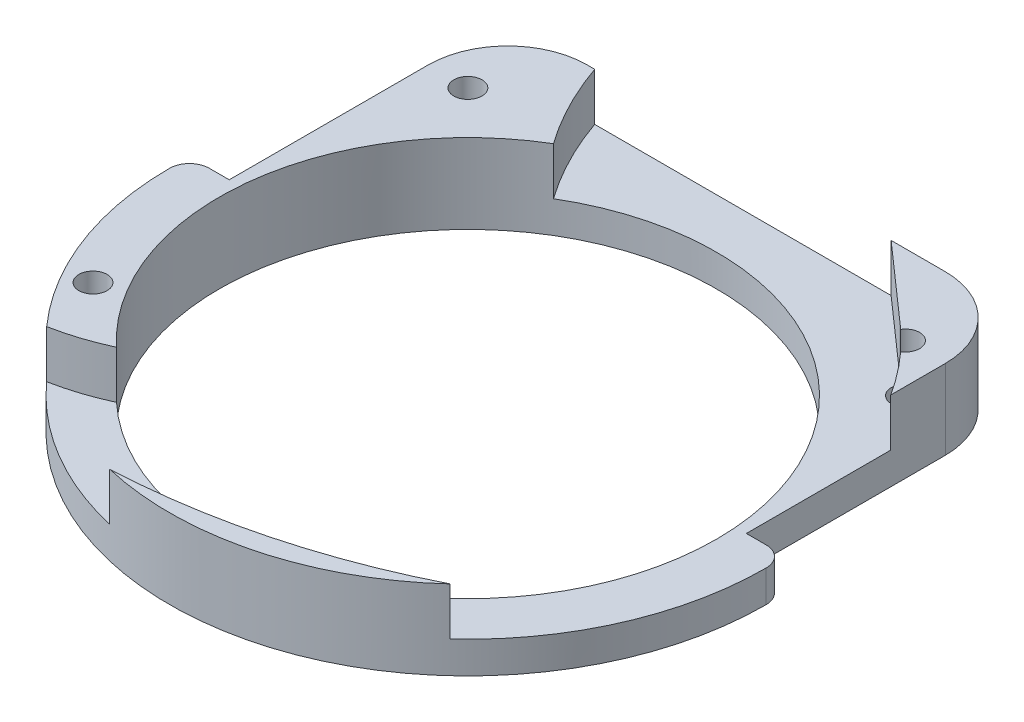
ISO-10303-21;
HEADER;
FILE_DESCRIPTION(('STEP AP214'),'2;1');
FILE_NAME('part.step','',(''),(''),'','','');
FILE_SCHEMA(('AUTOMOTIVE_DESIGN { 1 0 10303 214 1 1 1 1 }'));
ENDSEC;
DATA;
#1=APPLICATION_CONTEXT('core data for automotive mechanical design processes');
#2=APPLICATION_PROTOCOL_DEFINITION('international standard','automotive_design',2000,#1);
#3=PRODUCT_CONTEXT('',#1,'mechanical');
#4=PRODUCT('Part','Part','',(#3));
#5=PRODUCT_RELATED_PRODUCT_CATEGORY('part','',(#4));
#6=PRODUCT_DEFINITION_FORMATION('','',#4);
#7=PRODUCT_DEFINITION_CONTEXT('part definition',#1,'design');
#8=PRODUCT_DEFINITION('design','',#6,#7);
#9=PRODUCT_DEFINITION_SHAPE('','',#8);
#10=(LENGTH_UNIT() NAMED_UNIT(*) SI_UNIT(.MILLI.,.METRE.));
#11=(NAMED_UNIT(*) PLANE_ANGLE_UNIT() SI_UNIT($,.RADIAN.));
#12=(NAMED_UNIT(*) SI_UNIT($,.STERADIAN.) SOLID_ANGLE_UNIT());
#13=UNCERTAINTY_MEASURE_WITH_UNIT(LENGTH_MEASURE(1.E-05),#10,'distance_accuracy_value','');
#14=(GEOMETRIC_REPRESENTATION_CONTEXT(3) GLOBAL_UNCERTAINTY_ASSIGNED_CONTEXT((#13)) GLOBAL_UNIT_ASSIGNED_CONTEXT((#10,
#11,#12)) REPRESENTATION_CONTEXT('',''));
#15=CARTESIAN_POINT('',(0.,0.,0.));
#16=DIRECTION('',(0.,0.,1.));
#17=DIRECTION('',(1.,0.,0.));
#18=AXIS2_PLACEMENT_3D('',#15,#16,#17);
#19=CARTESIAN_POINT('',(0.,12.7,0.));
#20=DIRECTION('',(0.,1.,0.));
#21=DIRECTION('',(0.,0.,1.));
#22=AXIS2_PLACEMENT_3D('',#19,#20,#21);
#23=PLANE('',#22);
#24=CARTESIAN_POINT('',(-15.875,12.7,-60.325));
#25=DIRECTION('',(0.,1.,0.));
#26=DIRECTION('',(0.,0.,1.));
#27=AXIS2_PLACEMENT_3D('',#24,#25,#26);
#28=CIRCLE('',#27,106.828852586433);
#29=CARTESIAN_POINT('',(-10.8036837942564,12.7,46.3834134305974));
#30=VERTEX_POINT('',#29);
#31=CARTESIAN_POINT('',(32.2354567530664,12.7,35.0573238128808));
#32=VERTEX_POINT('',#31);
#33=EDGE_CURVE('E210',#30,#32,#28,.T.);
#34=ORIENTED_EDGE('',*,*,#33,.F.);
#35=CARTESIAN_POINT('',(0.,12.7,0.));
#36=DIRECTION('',(0.,1.,0.));
#37=DIRECTION('',(0.,0.,1.));
#38=AXIS2_PLACEMENT_3D('',#35,#36,#37);
#39=CIRCLE('',#38,47.625);
#40=EDGE_CURVE('E267',#30,#32,#39,.T.);
#41=ORIENTED_EDGE('',*,*,#40,.T.);
#42=EDGE_LOOP('',(#34,#41));
#43=FACE_BOUND('',#42,.T.);
#44=ADVANCED_FACE('F33',(#43),#23,.T.);
#45=CARTESIAN_POINT('',(-37.9449030668151,12.7,21.9075000000001));
#46=DIRECTION('',(0.,1.,0.));
#47=DIRECTION('',(0.,0.,1.));
#48=AXIS2_PLACEMENT_3D('',#45,#46,#47);
#49=CIRCLE('',#48,2.25);
#50=CARTESIAN_POINT('',(-37.9449030668151,12.7,24.1575000000001));
#51=VERTEX_POINT('',#50);
#52=EDGE_CURVE('E487',#51,#51,#49,.T.);
#53=ORIENTED_EDGE('',*,*,#52,.F.);
#54=EDGE_LOOP('',(#53));
#55=FACE_BOUND('',#54,.T.);
#56=CARTESIAN_POINT('',(-42.3702024676522,12.7,-3.85265724535526));
#57=DIRECTION('',(0.,-1.,0.));
#58=DIRECTION('',(0.,0.,1.));
#59=AXIS2_PLACEMENT_3D('',#56,#57,#58);
#60=CIRCLE('',#59,36.1950000000003);
#61=CARTESIAN_POINT('',(-27.1222333184053,12.7,28.9738177683229));
#62=VERTEX_POINT('',#61);
#63=CARTESIAN_POINT('',(-35.5479612812167,12.7,31.6935809549681));
#64=VERTEX_POINT('',#63);
#65=EDGE_CURVE('E219',#62,#64,#60,.T.);
#66=ORIENTED_EDGE('',*,*,#65,.F.);
#67=CARTESIAN_POINT('',(0.,12.7,0.));
#68=DIRECTION('',(0.,1.,0.));
#69=DIRECTION('',(0.,0.,1.));
#70=AXIS2_PLACEMENT_3D('',#67,#68,#69);
#71=CIRCLE('',#70,39.6875);
#72=CARTESIAN_POINT('',(-20.3892672085371,12.7,-34.049602625418));
#73=VERTEX_POINT('',#72);
#74=EDGE_CURVE('E257',#73,#62,#71,.T.);
#75=ORIENTED_EDGE('',*,*,#74,.F.);
#76=CARTESIAN_POINT('',(23.6115430728493,12.7,-65.310269918063));
#77=DIRECTION('',(0.,1.,0.));
#78=DIRECTION('',(0.,0.,-1.));
#79=AXIS2_PLACEMENT_3D('',#76,#77,#78);
#80=CIRCLE('',#79,53.975);
#81=CARTESIAN_POINT('',(-27.3838670434078,12.7,-47.625));
#82=VERTEX_POINT('',#81);
#83=EDGE_CURVE('E217',#82,#73,#80,.T.);
#84=ORIENTED_EDGE('',*,*,#83,.F.);
#85=DIRECTION('',(-1.,0.,0.));
#86=VECTOR('',#85,1.);
#87=CARTESIAN_POINT('',(-41.275,12.7,-47.625));
#88=LINE('',#87,#86);
#89=CARTESIAN_POINT('',(-28.575,12.7,-47.625));
#90=VERTEX_POINT('',#89);
#91=EDGE_CURVE('E269',#82,#90,#88,.T.);
#92=ORIENTED_EDGE('',*,*,#91,.T.);
#93=CARTESIAN_POINT('',(-28.575,12.7,-34.925));
#94=DIRECTION('',(0.,1.,0.));
#95=DIRECTION('',(0.,0.,1.));
#96=AXIS2_PLACEMENT_3D('',#93,#94,#95);
#97=CIRCLE('',#96,12.7);
#98=CARTESIAN_POINT('',(-41.275,12.7,-34.925));
#99=VERTEX_POINT('',#98);
#100=EDGE_CURVE('E315',#90,#99,#97,.T.);
#101=ORIENTED_EDGE('',*,*,#100,.T.);
#102=DIRECTION('',(0.,0.,1.));
#103=VECTOR('',#102,1.);
#104=CARTESIAN_POINT('',(-41.275,12.7,-3.175));
#105=LINE('',#104,#103);
#106=CARTESIAN_POINT('',(-41.275,12.7,-3.175));
#107=VERTEX_POINT('',#106);
#108=EDGE_CURVE('E273',#99,#107,#105,.T.);
#109=ORIENTED_EDGE('',*,*,#108,.T.);
#110=DIRECTION('',(-1.,0.,0.));
#111=VECTOR('',#110,1.);
#112=CARTESIAN_POINT('',(-47.625,12.7,-3.175));
#113=LINE('',#112,#111);
#114=CARTESIAN_POINT('',(-44.45,12.7,-3.175));
#115=VERTEX_POINT('',#114);
#116=EDGE_CURVE('E275',#107,#115,#113,.T.);
#117=ORIENTED_EDGE('',*,*,#116,.T.);
#118=CARTESIAN_POINT('',(-44.45,12.7,0.));
#119=DIRECTION('',(0.,1.,0.));
#120=DIRECTION('',(0.,0.,1.));
#121=AXIS2_PLACEMENT_3D('',#118,#119,#120);
#122=CIRCLE('',#121,3.175);
#123=CARTESIAN_POINT('',(-47.625,12.7,0.));
#124=VERTEX_POINT('',#123);
#125=EDGE_CURVE('E329',#115,#124,#122,.T.);
#126=ORIENTED_EDGE('',*,*,#125,.T.);
#127=EDGE_CURVE('E263',#124,#64,#39,.T.);
#128=ORIENTED_EDGE('',*,*,#127,.T.);
#129=EDGE_LOOP('',(#66,#75,#84,#92,#101,#109,#117,#126,#128));
#130=FACE_BOUND('',#129,.T.);
#131=CARTESIAN_POINT('',(-34.925,12.7,-34.925));
#132=DIRECTION('',(0.,1.,0.));
#133=DIRECTION('',(0.,0.,1.));
#134=AXIS2_PLACEMENT_3D('',#131,#132,#133);
#135=CIRCLE('',#134,2.25);
#136=CARTESIAN_POINT('',(-34.925,12.7,-32.675));
#137=VERTEX_POINT('',#136);
#138=EDGE_CURVE('E248',#137,#137,#135,.T.);
#139=ORIENTED_EDGE('',*,*,#138,.F.);
#140=EDGE_LOOP('',(#139));
#141=FACE_BOUND('',#140,.T.);
#142=ADVANCED_FACE('F356',(#55,#130,#141),#23,.T.);
#143=CARTESIAN_POINT('',(41.275,12.7,-3.175));
#144=DIRECTION('',(0.,0.,1.));
#145=DIRECTION('',(1.,0.,0.));
#146=AXIS2_PLACEMENT_3D('',#143,#144,#145);
#147=PLANE('',#146);
#148=DIRECTION('',(-1.,0.,0.));
#149=VECTOR('',#148,1.);
#150=CARTESIAN_POINT('',(41.275,5.08,-3.175));
#151=LINE('',#150,#149);
#152=CARTESIAN_POINT('',(44.45,5.08,-3.175));
#153=VERTEX_POINT('',#152);
#154=CARTESIAN_POINT('',(41.275,5.08,-3.175));
#155=VERTEX_POINT('',#154);
#156=EDGE_CURVE('E223',#153,#155,#151,.T.);
#157=ORIENTED_EDGE('',*,*,#156,.F.);
#158=DIRECTION('',(0.,-1.,0.));
#159=VECTOR('',#158,1.);
#160=CARTESIAN_POINT('',(44.45,12.7,-3.175));
#161=LINE('',#160,#159);
#162=CARTESIAN_POINT('',(44.45,0.,-3.175));
#163=VERTEX_POINT('',#162);
#164=EDGE_CURVE('E322',#153,#163,#161,.T.);
#165=ORIENTED_EDGE('',*,*,#164,.T.);
#166=DIRECTION('',(-1.,0.,0.));
#167=VECTOR('',#166,1.);
#168=CARTESIAN_POINT('',(41.275,0.,-3.175));
#169=LINE('',#168,#167);
#170=CARTESIAN_POINT('',(41.275,0.,-3.175));
#171=VERTEX_POINT('',#170);
#172=EDGE_CURVE('E280',#163,#171,#169,.T.);
#173=ORIENTED_EDGE('',*,*,#172,.T.);
#174=DIRECTION('',(0.,-1.,0.));
#175=VECTOR('',#174,1.);
#176=CARTESIAN_POINT('',(41.275,12.7,-3.175));
#177=LINE('',#176,#175);
#178=EDGE_CURVE('E298',#155,#171,#177,.T.);
#179=ORIENTED_EDGE('',*,*,#178,.F.);
#180=EDGE_LOOP('',(#157,#165,#173,#179));
#181=FACE_BOUND('',#180,.T.);
#182=ADVANCED_FACE('F362',(#181),#147,.F.);
#183=CARTESIAN_POINT('',(44.45,12.7,0.));
#184=DIRECTION('',(0.,-1.,0.));
#185=DIRECTION('',(0.,0.,-1.));
#186=AXIS2_PLACEMENT_3D('',#183,#184,#185);
#187=CYLINDRICAL_SURFACE('',#186,3.175);
#188=ORIENTED_EDGE('',*,*,#164,.F.);
#189=CARTESIAN_POINT('',(44.45,5.08,0.));
#190=DIRECTION('',(0.,1.,0.));
#191=DIRECTION('',(0.,0.,1.));
#192=AXIS2_PLACEMENT_3D('',#189,#190,#191);
#193=CIRCLE('',#192,3.175);
#194=CARTESIAN_POINT('',(47.625,5.08,0.));
#195=VERTEX_POINT('',#194);
#196=EDGE_CURVE('E196',#153,#195,#193,.F.);
#197=ORIENTED_EDGE('',*,*,#196,.T.);
#198=DIRECTION('',(0.,-1.,0.));
#199=VECTOR('',#198,1.);
#200=CARTESIAN_POINT('',(47.625,12.7,0.));
#201=LINE('',#200,#199);
#202=CARTESIAN_POINT('',(47.625,0.,0.));
#203=VERTEX_POINT('',#202);
#204=EDGE_CURVE('E300',#195,#203,#201,.T.);
#205=ORIENTED_EDGE('',*,*,#204,.T.);
#206=CARTESIAN_POINT('',(44.45,0.,0.));
#207=DIRECTION('',(0.,1.,0.));
#208=DIRECTION('',(0.,0.,1.));
#209=AXIS2_PLACEMENT_3D('',#206,#207,#208);
#210=CIRCLE('',#209,3.175);
#211=EDGE_CURVE('E326',#163,#203,#210,.F.);
#212=ORIENTED_EDGE('',*,*,#211,.F.);
#213=EDGE_LOOP('',(#188,#197,#205,#212));
#214=FACE_BOUND('',#213,.T.);
#215=ADVANCED_FACE('F368',(#214),#187,.T.);
#216=CARTESIAN_POINT('',(0.,12.7,0.));
#217=DIRECTION('',(0.,1.,0.));
#218=DIRECTION('',(0.,0.,1.));
#219=AXIS2_PLACEMENT_3D('',#216,#217,#218);
#220=CIRCLE('',#219,48.895);
#221=CARTESIAN_POINT('',(41.275,12.7,-26.2125046494989));
#222=VERTEX_POINT('',#221);
#223=CARTESIAN_POINT('',(36.0830947099074,12.7,-32.9959285542301));
#224=VERTEX_POINT('',#223);
#225=EDGE_CURVE('E214',#222,#224,#220,.T.);
#226=ORIENTED_EDGE('',*,*,#225,.F.);
#227=DIRECTION('',(0.,0.,-1.));
#228=VECTOR('',#227,1.);
#229=CARTESIAN_POINT('',(41.275,12.7,-47.625));
#230=LINE('',#229,#228);
#231=CARTESIAN_POINT('',(41.275,12.7,-34.925));
#232=VERTEX_POINT('',#231);
#233=EDGE_CURVE('E266',#222,#232,#230,.T.);
#234=ORIENTED_EDGE('',*,*,#233,.T.);
#235=CARTESIAN_POINT('',(28.575,12.7,-34.925));
#236=DIRECTION('',(0.,1.,0.));
#237=DIRECTION('',(0.,0.,1.));
#238=AXIS2_PLACEMENT_3D('',#235,#236,#237);
#239=CIRCLE('',#238,12.7);
#240=CARTESIAN_POINT('',(28.575,12.7,-47.625));
#241=VERTEX_POINT('',#240);
#242=EDGE_CURVE('E317',#232,#241,#239,.T.);
#243=ORIENTED_EDGE('',*,*,#242,.T.);
#244=CARTESIAN_POINT('',(19.9319379994338,12.7,-47.625));
#245=VERTEX_POINT('',#244);
#246=EDGE_CURVE('E270',#241,#245,#88,.T.);
#247=ORIENTED_EDGE('',*,*,#246,.T.);
#248=DIRECTION('',(-0.749700903034031,0.,-0.661776817356092));
#249=VECTOR('',#248,1.);
#250=CARTESIAN_POINT('',(32.3575774846261,12.7,-36.656625653849));
#251=LINE('',#250,#249);
#252=CARTESIAN_POINT('',(32.3575774846261,12.7,-36.656625653849));
#253=VERTEX_POINT('',#252);
#254=EDGE_CURVE('E215',#253,#245,#251,.T.);
#255=ORIENTED_EDGE('',*,*,#254,.F.);
#256=CARTESIAN_POINT('',(32.9959285542301,12.7,-36.0830947099074));
#257=VERTEX_POINT('',#256);
#258=EDGE_CURVE('E193',#257,#253,#220,.T.);
#259=ORIENTED_EDGE('',*,*,#258,.F.);
#260=CARTESIAN_POINT('',(34.925,12.7,-34.925));
#261=DIRECTION('',(0.,1.,0.));
#262=DIRECTION('',(0.,0.,1.));
#263=AXIS2_PLACEMENT_3D('',#260,#261,#262);
#264=CIRCLE('',#263,2.25);
#265=EDGE_CURVE('E244',#224,#257,#264,.T.);
#266=ORIENTED_EDGE('',*,*,#265,.F.);
#267=EDGE_LOOP('',(#226,#234,#243,#247,#255,#259,#266));
#268=FACE_BOUND('',#267,.T.);
#269=ADVANCED_FACE('F358',(#268),#23,.T.);
#270=CARTESIAN_POINT('',(0.,0.,0.));
#271=DIRECTION('',(0.,1.,0.));
#272=DIRECTION('',(0.,0.,1.));
#273=AXIS2_PLACEMENT_3D('',#270,#271,#272);
#274=PLANE('',#273);
#275=CARTESIAN_POINT('',(-37.9449030668151,0.,21.9075000000001));
#276=DIRECTION('',(0.,1.,0.));
#277=DIRECTION('',(0.,0.,1.));
#278=AXIS2_PLACEMENT_3D('',#275,#276,#277);
#279=CIRCLE('',#278,2.25);
#280=CARTESIAN_POINT('',(-37.9449030668151,0.,24.1575000000001));
#281=VERTEX_POINT('',#280);
#282=EDGE_CURVE('E212',#281,#281,#279,.T.);
#283=ORIENTED_EDGE('',*,*,#282,.T.);
#284=EDGE_LOOP('',(#283));
#285=FACE_BOUND('',#284,.T.);
#286=CARTESIAN_POINT('',(34.925,0.,-34.925));
#287=DIRECTION('',(0.,1.,0.));
#288=DIRECTION('',(0.,0.,1.));
#289=AXIS2_PLACEMENT_3D('',#286,#287,#288);
#290=CIRCLE('',#289,2.25);
#291=CARTESIAN_POINT('',(34.925,0.,-32.675));
#292=VERTEX_POINT('',#291);
#293=EDGE_CURVE('E245',#292,#292,#290,.T.);
#294=ORIENTED_EDGE('',*,*,#293,.T.);
#295=EDGE_LOOP('',(#294));
#296=FACE_BOUND('',#295,.T.);
#297=CARTESIAN_POINT('',(-34.925,0.,-34.925));
#298=DIRECTION('',(0.,1.,0.));
#299=DIRECTION('',(0.,0.,1.));
#300=AXIS2_PLACEMENT_3D('',#297,#298,#299);
#301=CIRCLE('',#300,2.25);
#302=CARTESIAN_POINT('',(-34.925,0.,-32.675));
#303=VERTEX_POINT('',#302);
#304=EDGE_CURVE('E251',#303,#303,#301,.T.);
#305=ORIENTED_EDGE('',*,*,#304,.T.);
#306=EDGE_LOOP('',(#305));
#307=FACE_BOUND('',#306,.T.);
#308=ORIENTED_EDGE('',*,*,#172,.F.);
#309=ORIENTED_EDGE('',*,*,#211,.T.);
#310=CARTESIAN_POINT('',(0.,0.,0.));
#311=DIRECTION('',(0.,1.,0.));
#312=DIRECTION('',(0.,0.,1.));
#313=AXIS2_PLACEMENT_3D('',#310,#311,#312);
#314=CIRCLE('',#313,47.625);
#315=CARTESIAN_POINT('',(-47.625,0.,0.));
#316=VERTEX_POINT('',#315);
#317=EDGE_CURVE('E260',#316,#203,#314,.T.);
#318=ORIENTED_EDGE('',*,*,#317,.F.);
#319=CARTESIAN_POINT('',(-44.45,0.,0.));
#320=DIRECTION('',(0.,1.,0.));
#321=DIRECTION('',(0.,0.,1.));
#322=AXIS2_PLACEMENT_3D('',#319,#320,#321);
#323=CIRCLE('',#322,3.175);
#324=CARTESIAN_POINT('',(-44.45,0.,-3.175));
#325=VERTEX_POINT('',#324);
#326=EDGE_CURVE('E324',#316,#325,#323,.F.);
#327=ORIENTED_EDGE('',*,*,#326,.T.);
#328=DIRECTION('',(-1.,0.,0.));
#329=VECTOR('',#328,1.);
#330=CARTESIAN_POINT('',(-47.625,0.,-3.175));
#331=LINE('',#330,#329);
#332=CARTESIAN_POINT('',(-41.275,0.,-3.175));
#333=VERTEX_POINT('',#332);
#334=EDGE_CURVE('E291',#333,#325,#331,.T.);
#335=ORIENTED_EDGE('',*,*,#334,.F.);
#336=DIRECTION('',(0.,0.,1.));
#337=VECTOR('',#336,1.);
#338=CARTESIAN_POINT('',(-41.275,0.,-3.175));
#339=LINE('',#338,#337);
#340=CARTESIAN_POINT('',(-41.275,0.,-34.925));
#341=VERTEX_POINT('',#340);
#342=EDGE_CURVE('E289',#341,#333,#339,.T.);
#343=ORIENTED_EDGE('',*,*,#342,.F.);
#344=CARTESIAN_POINT('',(-28.575,0.,-34.925));
#345=DIRECTION('',(0.,1.,0.));
#346=DIRECTION('',(0.,0.,1.));
#347=AXIS2_PLACEMENT_3D('',#344,#345,#346);
#348=CIRCLE('',#347,12.7);
#349=CARTESIAN_POINT('',(-28.575,0.,-47.625));
#350=VERTEX_POINT('',#349);
#351=EDGE_CURVE('E308',#341,#350,#348,.F.);
#352=ORIENTED_EDGE('',*,*,#351,.T.);
#353=DIRECTION('',(-1.,0.,0.));
#354=VECTOR('',#353,1.);
#355=CARTESIAN_POINT('',(-41.275,0.,-47.625));
#356=LINE('',#355,#354);
#357=CARTESIAN_POINT('',(28.575,0.,-47.625));
#358=VERTEX_POINT('',#357);
#359=EDGE_CURVE('E286',#358,#350,#356,.T.);
#360=ORIENTED_EDGE('',*,*,#359,.F.);
#361=CARTESIAN_POINT('',(28.575,0.,-34.925));
#362=DIRECTION('',(0.,1.,0.));
#363=DIRECTION('',(0.,0.,1.));
#364=AXIS2_PLACEMENT_3D('',#361,#362,#363);
#365=CIRCLE('',#364,12.7);
#366=CARTESIAN_POINT('',(41.275,0.,-34.925));
#367=VERTEX_POINT('',#366);
#368=EDGE_CURVE('E310',#358,#367,#365,.F.);
#369=ORIENTED_EDGE('',*,*,#368,.T.);
#370=DIRECTION('',(0.,0.,-1.));
#371=VECTOR('',#370,1.);
#372=CARTESIAN_POINT('',(41.275,0.,-47.625));
#373=LINE('',#372,#371);
#374=EDGE_CURVE('E283',#171,#367,#373,.T.);
#375=ORIENTED_EDGE('',*,*,#374,.F.);
#376=EDGE_LOOP('',(#308,#309,#318,#327,#335,#343,#352,#360,#369,#375));
#377=FACE_BOUND('',#376,.T.);
#378=CARTESIAN_POINT('',(0.,0.,0.));
#379=DIRECTION('',(0.,1.,0.));
#380=DIRECTION('',(0.,0.,1.));
#381=AXIS2_PLACEMENT_3D('',#378,#379,#380);
#382=CIRCLE('',#381,39.6875);
#383=CARTESIAN_POINT('',(0.,0.,39.6875));
#384=VERTEX_POINT('',#383);
#385=EDGE_CURVE('E254',#384,#384,#382,.T.);
#386=ORIENTED_EDGE('',*,*,#385,.T.);
#387=EDGE_LOOP('',(#386));
#388=FACE_BOUND('',#387,.T.);
#389=ADVANCED_FACE('F367',(#285,#296,#307,#377,#388),#274,.F.);
#390=CARTESIAN_POINT('',(0.,12.7,0.));
#391=DIRECTION('',(0.,-1.,0.));
#392=DIRECTION('',(0.,0.,-1.));
#393=AXIS2_PLACEMENT_3D('',#390,#391,#392);
#394=CYLINDRICAL_SURFACE('',#393,47.625);
#395=CARTESIAN_POINT('',(0.,5.08,0.));
#396=DIRECTION('',(0.,1.,0.));
#397=DIRECTION('',(0.,0.,1.));
#398=AXIS2_PLACEMENT_3D('',#395,#396,#397);
#399=CIRCLE('',#398,47.625);
#400=CARTESIAN_POINT('',(32.2354567530664,5.08,35.0573238128808));
#401=VERTEX_POINT('',#400);
#402=EDGE_CURVE('E225',#401,#195,#399,.T.);
#403=ORIENTED_EDGE('',*,*,#402,.F.);
#404=DIRECTION('',(0.,1.,0.));
#405=VECTOR('',#404,1.);
#406=CARTESIAN_POINT('',(32.2354567530665,8.89,35.0573238128808));
#407=LINE('',#406,#405);
#408=EDGE_CURVE('E11',#401,#32,#407,.T.);
#409=ORIENTED_EDGE('',*,*,#408,.T.);
#410=ORIENTED_EDGE('',*,*,#40,.F.);
#411=DIRECTION('',(0.,1.,0.));
#412=VECTOR('',#411,1.);
#413=CARTESIAN_POINT('',(-10.8036837942565,8.89,46.3834134305974));
#414=LINE('',#413,#412);
#415=CARTESIAN_POINT('',(-10.8036837942564,5.08,46.3834134305974));
#416=VERTEX_POINT('',#415);
#417=EDGE_CURVE('E41',#30,#416,#414,.F.);
#418=ORIENTED_EDGE('',*,*,#417,.T.);
#419=CARTESIAN_POINT('',(-35.5479612812167,5.08,31.6935809549681));
#420=VERTEX_POINT('',#419);
#421=EDGE_CURVE('E228',#420,#416,#399,.T.);
#422=ORIENTED_EDGE('',*,*,#421,.F.);
#423=DIRECTION('',(0.,1.,0.));
#424=VECTOR('',#423,1.);
#425=CARTESIAN_POINT('',(-35.5479612812167,8.89,31.6935809549681));
#426=LINE('',#425,#424);
#427=EDGE_CURVE('E241',#420,#64,#426,.T.);
#428=ORIENTED_EDGE('',*,*,#427,.T.);
#429=ORIENTED_EDGE('',*,*,#127,.F.);
#430=DIRECTION('',(0.,-1.,0.));
#431=VECTOR('',#430,1.);
#432=CARTESIAN_POINT('',(-47.625,12.7,0.));
#433=LINE('',#432,#431);
#434=EDGE_CURVE('E277',#124,#316,#433,.T.);
#435=ORIENTED_EDGE('',*,*,#434,.T.);
#436=ORIENTED_EDGE('',*,*,#317,.T.);
#437=ORIENTED_EDGE('',*,*,#204,.F.);
#438=EDGE_LOOP('',(#403,#409,#410,#418,#422,#428,#429,#435,#436,#437));
#439=FACE_BOUND('',#438,.T.);
#440=ADVANCED_FACE('F347',(#439),#394,.T.);
#441=CARTESIAN_POINT('',(41.275,12.7,-47.625));
#442=DIRECTION('',(-1.,0.,0.));
#443=DIRECTION('',(0.,0.,1.));
#444=AXIS2_PLACEMENT_3D('',#441,#442,#443);
#445=PLANE('',#444);
#446=ORIENTED_EDGE('',*,*,#233,.F.);
#447=DIRECTION('',(0.,1.,0.));
#448=VECTOR('',#447,1.);
#449=CARTESIAN_POINT('',(41.275,5.08,-26.2125046494989));
#450=LINE('',#449,#448);
#451=CARTESIAN_POINT('',(41.275,5.08,-26.2125046494989));
#452=VERTEX_POINT('',#451);
#453=EDGE_CURVE('E235',#222,#452,#450,.F.);
#454=ORIENTED_EDGE('',*,*,#453,.T.);
#455=DIRECTION('',(0.,0.,-1.));
#456=VECTOR('',#455,1.);
#457=CARTESIAN_POINT('',(41.275,5.08,-47.625));
#458=LINE('',#457,#456);
#459=EDGE_CURVE('E227',#155,#452,#458,.T.);
#460=ORIENTED_EDGE('',*,*,#459,.F.);
#461=ORIENTED_EDGE('',*,*,#178,.T.);
#462=ORIENTED_EDGE('',*,*,#374,.T.);
#463=DIRECTION('',(0.,-1.,0.));
#464=VECTOR('',#463,1.);
#465=CARTESIAN_POINT('',(41.275,12.7,-34.925));
#466=LINE('',#465,#464);
#467=EDGE_CURVE('E312',#367,#232,#466,.F.);
#468=ORIENTED_EDGE('',*,*,#467,.T.);
#469=EDGE_LOOP('',(#446,#454,#460,#461,#462,#468));
#470=FACE_BOUND('',#469,.T.);
#471=ADVANCED_FACE('F381',(#470),#445,.F.);
#472=CARTESIAN_POINT('',(-41.275,12.7,-47.625));
#473=DIRECTION('',(0.,0.,1.));
#474=DIRECTION('',(1.,0.,0.));
#475=AXIS2_PLACEMENT_3D('',#472,#473,#474);
#476=PLANE('',#475);
#477=ORIENTED_EDGE('',*,*,#91,.F.);
#478=DIRECTION('',(0.,1.,0.));
#479=VECTOR('',#478,1.);
#480=CARTESIAN_POINT('',(-27.3838670434078,5.08,-47.625));
#481=LINE('',#480,#479);
#482=CARTESIAN_POINT('',(-27.3838670434078,5.08,-47.625));
#483=VERTEX_POINT('',#482);
#484=EDGE_CURVE('E238',#82,#483,#481,.F.);
#485=ORIENTED_EDGE('',*,*,#484,.T.);
#486=DIRECTION('',(-1.,0.,0.));
#487=VECTOR('',#486,1.);
#488=CARTESIAN_POINT('',(-41.275,5.08,-47.625));
#489=LINE('',#488,#487);
#490=CARTESIAN_POINT('',(19.9319379994338,5.08,-47.625));
#491=VERTEX_POINT('',#490);
#492=EDGE_CURVE('E233',#491,#483,#489,.T.);
#493=ORIENTED_EDGE('',*,*,#492,.F.);
#494=DIRECTION('',(0.,1.,0.));
#495=VECTOR('',#494,1.);
#496=CARTESIAN_POINT('',(19.9319379994338,12.7,-47.625));
#497=LINE('',#496,#495);
#498=EDGE_CURVE('E201',#491,#245,#497,.T.);
#499=ORIENTED_EDGE('',*,*,#498,.T.);
#500=ORIENTED_EDGE('',*,*,#246,.F.);
#501=DIRECTION('',(0.,-1.,0.));
#502=VECTOR('',#501,1.);
#503=CARTESIAN_POINT('',(28.575,12.7,-47.625));
#504=LINE('',#503,#502);
#505=EDGE_CURVE('E305',#241,#358,#504,.T.);
#506=ORIENTED_EDGE('',*,*,#505,.T.);
#507=ORIENTED_EDGE('',*,*,#359,.T.);
#508=DIRECTION('',(0.,-1.,0.));
#509=VECTOR('',#508,1.);
#510=CARTESIAN_POINT('',(-28.575,12.7,-47.625));
#511=LINE('',#510,#509);
#512=EDGE_CURVE('E302',#350,#90,#511,.F.);
#513=ORIENTED_EDGE('',*,*,#512,.T.);
#514=EDGE_LOOP('',(#477,#485,#493,#499,#500,#506,#507,#513));
#515=FACE_BOUND('',#514,.T.);
#516=ADVANCED_FACE('F392',(#515),#476,.F.);
#517=CARTESIAN_POINT('',(-41.275,12.7,-3.175));
#518=DIRECTION('',(1.,0.,0.));
#519=DIRECTION('',(0.,0.,-1.));
#520=AXIS2_PLACEMENT_3D('',#517,#518,#519);
#521=PLANE('',#520);
#522=ORIENTED_EDGE('',*,*,#108,.F.);
#523=DIRECTION('',(0.,-1.,0.));
#524=VECTOR('',#523,1.);
#525=CARTESIAN_POINT('',(-41.275,12.7,-34.925));
#526=LINE('',#525,#524);
#527=EDGE_CURVE('E319',#99,#341,#526,.T.);
#528=ORIENTED_EDGE('',*,*,#527,.T.);
#529=ORIENTED_EDGE('',*,*,#342,.T.);
#530=DIRECTION('',(0.,-1.,0.));
#531=VECTOR('',#530,1.);
#532=CARTESIAN_POINT('',(-41.275,12.7,-3.175));
#533=LINE('',#532,#531);
#534=EDGE_CURVE('E295',#107,#333,#533,.T.);
#535=ORIENTED_EDGE('',*,*,#534,.F.);
#536=EDGE_LOOP('',(#522,#528,#529,#535));
#537=FACE_BOUND('',#536,.T.);
#538=ADVANCED_FACE('F424',(#537),#521,.F.);
#539=CARTESIAN_POINT('',(-47.625,12.7,-3.175));
#540=DIRECTION('',(0.,0.,1.));
#541=DIRECTION('',(1.,0.,0.));
#542=AXIS2_PLACEMENT_3D('',#539,#540,#541);
#543=PLANE('',#542);
#544=ORIENTED_EDGE('',*,*,#334,.T.);
#545=DIRECTION('',(0.,-1.,0.));
#546=VECTOR('',#545,1.);
#547=CARTESIAN_POINT('',(-44.45,12.7,-3.175));
#548=LINE('',#547,#546);
#549=EDGE_CURVE('E56',#325,#115,#548,.F.);
#550=ORIENTED_EDGE('',*,*,#549,.T.);
#551=ORIENTED_EDGE('',*,*,#116,.F.);
#552=ORIENTED_EDGE('',*,*,#534,.T.);
#553=EDGE_LOOP('',(#544,#550,#551,#552));
#554=FACE_BOUND('',#553,.T.);
#555=ADVANCED_FACE('F420',(#554),#543,.F.);
#556=CARTESIAN_POINT('',(0.,12.7,0.));
#557=DIRECTION('',(0.,-1.,0.));
#558=DIRECTION('',(0.,0.,-1.));
#559=AXIS2_PLACEMENT_3D('',#556,#557,#558);
#560=CYLINDRICAL_SURFACE('',#559,39.6875);
#561=DIRECTION('',(0.,1.,0.));
#562=VECTOR('',#561,1.);
#563=CARTESIAN_POINT('',(-27.1222333184053,8.89,28.9738177683229));
#564=LINE('',#563,#562);
#565=CARTESIAN_POINT('',(-27.1222333184053,5.08,28.9738177683229));
#566=VERTEX_POINT('',#565);
#567=EDGE_CURVE('E340',#566,#62,#564,.T.);
#568=ORIENTED_EDGE('',*,*,#567,.F.);
#569=CARTESIAN_POINT('',(0.,5.08,0.));
#570=DIRECTION('',(0.,1.,0.));
#571=DIRECTION('',(0.,0.,1.));
#572=AXIS2_PLACEMENT_3D('',#569,#570,#571);
#573=CIRCLE('',#572,39.6875);
#574=CARTESIAN_POINT('',(-20.3892672085371,5.08,-34.049602625418));
#575=VERTEX_POINT('',#574);
#576=EDGE_CURVE('E230',#566,#575,#573,.T.);
#577=ORIENTED_EDGE('',*,*,#576,.T.);
#578=DIRECTION('',(0.,1.,0.));
#579=VECTOR('',#578,1.);
#580=CARTESIAN_POINT('',(-20.3892672085371,8.89,-34.049602625418));
#581=LINE('',#580,#579);
#582=EDGE_CURVE('E338',#73,#575,#581,.F.);
#583=ORIENTED_EDGE('',*,*,#582,.F.);
#584=ORIENTED_EDGE('',*,*,#74,.T.);
#585=EDGE_LOOP('',(#568,#577,#583,#584));
#586=FACE_BOUND('',#585,.T.);
#587=ORIENTED_EDGE('',*,*,#385,.F.);
#588=EDGE_LOOP('',(#587));
#589=FACE_BOUND('',#588,.T.);
#590=ADVANCED_FACE('F402',(#586,#589),#560,.F.);
#591=CARTESIAN_POINT('',(28.575,12.7,-34.925));
#592=DIRECTION('',(0.,-1.,0.));
#593=DIRECTION('',(0.,0.,-1.));
#594=AXIS2_PLACEMENT_3D('',#591,#592,#593);
#595=CYLINDRICAL_SURFACE('',#594,12.7);
#596=ORIENTED_EDGE('',*,*,#242,.F.);
#597=ORIENTED_EDGE('',*,*,#467,.F.);
#598=ORIENTED_EDGE('',*,*,#368,.F.);
#599=ORIENTED_EDGE('',*,*,#505,.F.);
#600=EDGE_LOOP('',(#596,#597,#598,#599));
#601=FACE_BOUND('',#600,.T.);
#602=ADVANCED_FACE('F388',(#601),#595,.T.);
#603=CARTESIAN_POINT('',(-28.575,12.7,-34.925));
#604=DIRECTION('',(0.,-1.,0.));
#605=DIRECTION('',(0.,0.,-1.));
#606=AXIS2_PLACEMENT_3D('',#603,#604,#605);
#607=CYLINDRICAL_SURFACE('',#606,12.7);
#608=ORIENTED_EDGE('',*,*,#100,.F.);
#609=ORIENTED_EDGE('',*,*,#512,.F.);
#610=ORIENTED_EDGE('',*,*,#351,.F.);
#611=ORIENTED_EDGE('',*,*,#527,.F.);
#612=EDGE_LOOP('',(#608,#609,#610,#611));
#613=FACE_BOUND('',#612,.T.);
#614=ADVANCED_FACE('F429',(#613),#607,.T.);
#615=CARTESIAN_POINT('',(-44.45,12.7,0.));
#616=DIRECTION('',(0.,-1.,0.));
#617=DIRECTION('',(0.,0.,-1.));
#618=AXIS2_PLACEMENT_3D('',#615,#616,#617);
#619=CYLINDRICAL_SURFACE('',#618,3.175);
#620=ORIENTED_EDGE('',*,*,#125,.F.);
#621=ORIENTED_EDGE('',*,*,#549,.F.);
#622=ORIENTED_EDGE('',*,*,#326,.F.);
#623=ORIENTED_EDGE('',*,*,#434,.F.);
#624=EDGE_LOOP('',(#620,#621,#622,#623));
#625=FACE_BOUND('',#624,.T.);
#626=ADVANCED_FACE('F35',(#625),#619,.T.);
#627=CARTESIAN_POINT('',(-34.925,0.,-34.925));
#628=DIRECTION('',(0.,1.,0.));
#629=DIRECTION('',(0.,0.,1.));
#630=AXIS2_PLACEMENT_3D('',#627,#628,#629);
#631=CYLINDRICAL_SURFACE('',#630,2.25);
#632=ORIENTED_EDGE('',*,*,#304,.F.);
#633=EDGE_LOOP('',(#632));
#634=FACE_BOUND('',#633,.T.);
#635=ORIENTED_EDGE('',*,*,#138,.T.);
#636=EDGE_LOOP('',(#635));
#637=FACE_BOUND('',#636,.T.);
#638=ADVANCED_FACE('F436',(#634,#637),#631,.F.);
#639=CARTESIAN_POINT('',(34.925,0.,-34.925));
#640=DIRECTION('',(0.,1.,0.));
#641=DIRECTION('',(0.,0.,1.));
#642=AXIS2_PLACEMENT_3D('',#639,#640,#641);
#643=CYLINDRICAL_SURFACE('',#642,2.25);
#644=ORIENTED_EDGE('',*,*,#293,.F.);
#645=EDGE_LOOP('',(#644));
#646=FACE_BOUND('',#645,.T.);
#647=CARTESIAN_POINT('',(34.925,5.08,-34.925));
#648=DIRECTION('',(0.,1.,0.));
#649=DIRECTION('',(0.,0.,1.));
#650=AXIS2_PLACEMENT_3D('',#647,#648,#649);
#651=CIRCLE('',#650,2.25);
#652=CARTESIAN_POINT('',(36.0830947099074,5.08,-32.9959285542301));
#653=VERTEX_POINT('',#652);
#654=CARTESIAN_POINT('',(32.9959285542301,5.08,-36.0830947099074));
#655=VERTEX_POINT('',#654);
#656=EDGE_CURVE('E184',#653,#655,#651,.F.);
#657=ORIENTED_EDGE('',*,*,#656,.F.);
#658=DIRECTION('',(0.,1.,0.));
#659=VECTOR('',#658,1.);
#660=CARTESIAN_POINT('',(36.0830947099073,8.89,-32.9959285542301));
#661=LINE('',#660,#659);
#662=EDGE_CURVE('E335',#653,#224,#661,.T.);
#663=ORIENTED_EDGE('',*,*,#662,.T.);
#664=ORIENTED_EDGE('',*,*,#265,.T.);
#665=DIRECTION('',(0.,1.,0.));
#666=VECTOR('',#665,1.);
#667=CARTESIAN_POINT('',(32.9959285542301,8.89,-36.0830947099073));
#668=LINE('',#667,#666);
#669=EDGE_CURVE('E333',#257,#655,#668,.F.);
#670=ORIENTED_EDGE('',*,*,#669,.T.);
#671=EDGE_LOOP('',(#657,#663,#664,#670));
#672=FACE_BOUND('',#671,.T.);
#673=ADVANCED_FACE('F459',(#646,#672),#643,.F.);
#674=CARTESIAN_POINT('',(-15.875,5.08,-60.325));
#675=DIRECTION('',(0.,1.,0.));
#676=DIRECTION('',(0.,0.,1.));
#677=AXIS2_PLACEMENT_3D('',#674,#675,#676);
#678=CYLINDRICAL_SURFACE('',#677,106.828852586433);
#679=CARTESIAN_POINT('',(-15.875,5.08,-60.325));
#680=DIRECTION('',(0.,1.,0.));
#681=DIRECTION('',(0.,0.,1.));
#682=AXIS2_PLACEMENT_3D('',#679,#680,#681);
#683=CIRCLE('',#682,106.828852586433);
#684=EDGE_CURVE('E187',#416,#401,#683,.T.);
#685=ORIENTED_EDGE('',*,*,#684,.F.);
#686=ORIENTED_EDGE('',*,*,#417,.F.);
#687=ORIENTED_EDGE('',*,*,#33,.T.);
#688=ORIENTED_EDGE('',*,*,#408,.F.);
#689=EDGE_LOOP('',(#685,#686,#687,#688));
#690=FACE_BOUND('',#689,.T.);
#691=ADVANCED_FACE('F352',(#690),#678,.F.);
#692=CARTESIAN_POINT('',(32.3575774846261,5.08,-36.656625653849));
#693=DIRECTION('',(0.661776817356092,0.,-0.749700903034031));
#694=DIRECTION('',(-0.749700903034031,0.,-0.661776817356092));
#695=AXIS2_PLACEMENT_3D('',#692,#693,#694);
#696=PLANE('',#695);
#697=DIRECTION('',(-0.749700903034031,0.,-0.661776817356092));
#698=VECTOR('',#697,1.);
#699=CARTESIAN_POINT('',(32.3575774846261,5.08,-36.656625653849));
#700=LINE('',#699,#698);
#701=CARTESIAN_POINT('',(32.3575774846261,5.08,-36.656625653849));
#702=VERTEX_POINT('',#701);
#703=EDGE_CURVE('E181',#702,#491,#700,.T.);
#704=ORIENTED_EDGE('',*,*,#703,.F.);
#705=DIRECTION('',(0.,1.,0.));
#706=VECTOR('',#705,1.);
#707=CARTESIAN_POINT('',(32.3575774846261,5.08,-36.656625653849));
#708=LINE('',#707,#706);
#709=EDGE_CURVE('E190',#702,#253,#708,.T.);
#710=ORIENTED_EDGE('',*,*,#709,.T.);
#711=ORIENTED_EDGE('',*,*,#254,.T.);
#712=ORIENTED_EDGE('',*,*,#498,.F.);
#713=EDGE_LOOP('',(#704,#710,#711,#712));
#714=FACE_BOUND('',#713,.T.);
#715=ADVANCED_FACE('F199',(#714),#696,.F.);
#716=CARTESIAN_POINT('',(-42.3702024676522,5.08,-3.85265724535526));
#717=DIRECTION('',(0.,1.,0.));
#718=DIRECTION('',(0.,0.,1.));
#719=AXIS2_PLACEMENT_3D('',#716,#717,#718);
#720=CYLINDRICAL_SURFACE('',#719,36.1950000000003);
#721=CARTESIAN_POINT('',(-42.3702024676522,5.08,-3.85265724535526));
#722=DIRECTION('',(0.,-1.,0.));
#723=DIRECTION('',(0.,0.,1.));
#724=AXIS2_PLACEMENT_3D('',#721,#722,#723);
#725=CIRCLE('',#724,36.1950000000003);
#726=EDGE_CURVE('E197',#566,#420,#725,.T.);
#727=ORIENTED_EDGE('',*,*,#726,.F.);
#728=ORIENTED_EDGE('',*,*,#567,.T.);
#729=ORIENTED_EDGE('',*,*,#65,.T.);
#730=ORIENTED_EDGE('',*,*,#427,.F.);
#731=EDGE_LOOP('',(#727,#728,#729,#730));
#732=FACE_BOUND('',#731,.T.);
#733=ADVANCED_FACE('F410',(#732),#720,.T.);
#734=CARTESIAN_POINT('',(23.6115430728493,5.08,-65.310269918063));
#735=DIRECTION('',(0.,1.,0.));
#736=DIRECTION('',(0.,0.,1.));
#737=AXIS2_PLACEMENT_3D('',#734,#735,#736);
#738=CYLINDRICAL_SURFACE('',#737,53.975);
#739=ORIENTED_EDGE('',*,*,#83,.T.);
#740=ORIENTED_EDGE('',*,*,#582,.T.);
#741=CARTESIAN_POINT('',(23.6115430728493,5.08,-65.310269918063));
#742=DIRECTION('',(0.,1.,0.));
#743=DIRECTION('',(0.,0.,-1.));
#744=AXIS2_PLACEMENT_3D('',#741,#742,#743);
#745=CIRCLE('',#744,53.975);
#746=EDGE_CURVE('E202',#483,#575,#745,.T.);
#747=ORIENTED_EDGE('',*,*,#746,.F.);
#748=ORIENTED_EDGE('',*,*,#484,.F.);
#749=EDGE_LOOP('',(#739,#740,#747,#748));
#750=FACE_BOUND('',#749,.T.);
#751=ADVANCED_FACE('F396',(#750),#738,.F.);
#752=CARTESIAN_POINT('',(0.,5.08,0.));
#753=DIRECTION('',(0.,1.,0.));
#754=DIRECTION('',(0.,0.,1.));
#755=AXIS2_PLACEMENT_3D('',#752,#753,#754);
#756=CYLINDRICAL_SURFACE('',#755,48.895);
#757=ORIENTED_EDGE('',*,*,#225,.T.);
#758=ORIENTED_EDGE('',*,*,#662,.F.);
#759=CARTESIAN_POINT('',(0.,5.08,0.));
#760=DIRECTION('',(0.,1.,0.));
#761=DIRECTION('',(0.,0.,1.));
#762=AXIS2_PLACEMENT_3D('',#759,#760,#761);
#763=CIRCLE('',#762,48.895);
#764=EDGE_CURVE('E48',#452,#653,#763,.T.);
#765=ORIENTED_EDGE('',*,*,#764,.F.);
#766=ORIENTED_EDGE('',*,*,#453,.F.);
#767=EDGE_LOOP('',(#757,#758,#765,#766));
#768=FACE_BOUND('',#767,.T.);
#769=ADVANCED_FACE('F466',(#768),#756,.F.);
#770=ORIENTED_EDGE('',*,*,#258,.T.);
#771=ORIENTED_EDGE('',*,*,#709,.F.);
#772=EDGE_CURVE('E177',#655,#702,#763,.T.);
#773=ORIENTED_EDGE('',*,*,#772,.F.);
#774=ORIENTED_EDGE('',*,*,#669,.F.);
#775=EDGE_LOOP('',(#770,#771,#773,#774));
#776=FACE_BOUND('',#775,.T.);
#777=ADVANCED_FACE('F191',(#776),#756,.F.);
#778=CARTESIAN_POINT('',(-15.875,5.08,-60.325));
#779=DIRECTION('',(0.,1.,0.));
#780=DIRECTION('',(0.,0.,1.));
#781=AXIS2_PLACEMENT_3D('',#778,#779,#780);
#782=PLANE('',#781);
#783=ORIENTED_EDGE('',*,*,#421,.T.);
#784=ORIENTED_EDGE('',*,*,#684,.T.);
#785=ORIENTED_EDGE('',*,*,#402,.T.);
#786=ORIENTED_EDGE('',*,*,#196,.F.);
#787=ORIENTED_EDGE('',*,*,#156,.T.);
#788=ORIENTED_EDGE('',*,*,#459,.T.);
#789=ORIENTED_EDGE('',*,*,#764,.T.);
#790=ORIENTED_EDGE('',*,*,#656,.T.);
#791=ORIENTED_EDGE('',*,*,#772,.T.);
#792=ORIENTED_EDGE('',*,*,#703,.T.);
#793=ORIENTED_EDGE('',*,*,#492,.T.);
#794=ORIENTED_EDGE('',*,*,#746,.T.);
#795=ORIENTED_EDGE('',*,*,#576,.F.);
#796=ORIENTED_EDGE('',*,*,#726,.T.);
#797=EDGE_LOOP('',(#783,#784,#785,#786,#787,#788,#789,#790,#791,#792,#793,#794,#795,#796));
#798=FACE_BOUND('',#797,.T.);
#799=ADVANCED_FACE('F179',(#798),#782,.T.);
#800=CARTESIAN_POINT('',(-37.9449030668151,0.,21.9075000000001));
#801=DIRECTION('',(0.,1.,0.));
#802=DIRECTION('',(0.,0.,1.));
#803=AXIS2_PLACEMENT_3D('',#800,#801,#802);
#804=CYLINDRICAL_SURFACE('',#803,2.25);
#805=ORIENTED_EDGE('',*,*,#282,.F.);
#806=EDGE_LOOP('',(#805));
#807=FACE_BOUND('',#806,.T.);
#808=ORIENTED_EDGE('',*,*,#52,.T.);
#809=EDGE_LOOP('',(#808));
#810=FACE_BOUND('',#809,.T.);
#811=ADVANCED_FACE('F477',(#807,#810),#804,.F.);
#812=CLOSED_SHELL('',(#44,#142,#182,#215,#269,#389,#440,#471,#516,#538,#555,#590,#602,#614,#626,
#638,#673,#691,#715,#733,#751,#769,#777,#799,#811));
#813=MANIFOLD_SOLID_BREP('B2',#812);
#814=ADVANCED_BREP_SHAPE_REPRESENTATION('',(#18,#813),#14);
#815=SHAPE_DEFINITION_REPRESENTATION(#9,#814);
ENDSEC;
END-ISO-10303-21;
